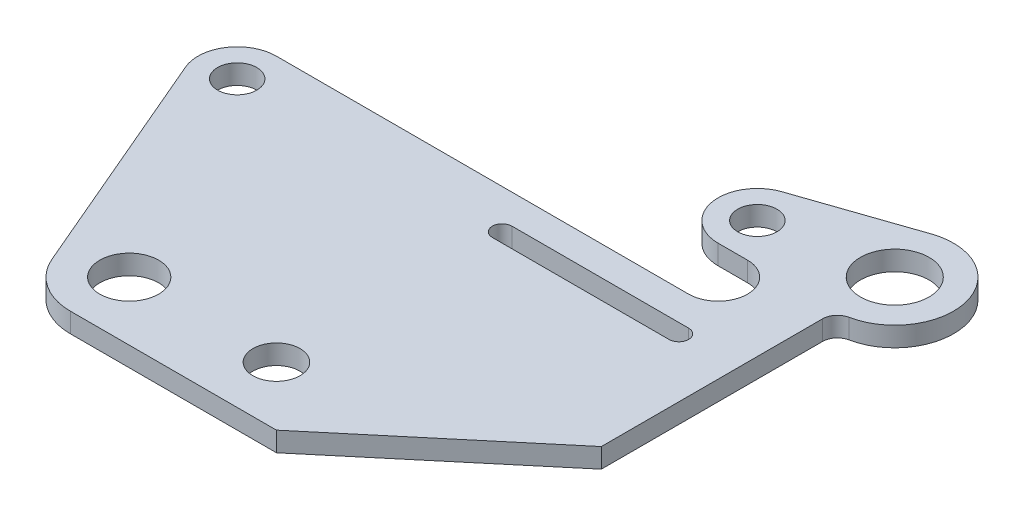
ISO-10303-21;
HEADER;
FILE_DESCRIPTION(('STEP AP214'),'2;1');
FILE_NAME('part.step','',(''),(''),'','','');
FILE_SCHEMA(('AUTOMOTIVE_DESIGN { 1 0 10303 214 1 1 1 1 }'));
ENDSEC;
DATA;
#1=APPLICATION_CONTEXT('core data for automotive mechanical design processes');
#2=APPLICATION_PROTOCOL_DEFINITION('international standard','automotive_design',2000,#1);
#3=PRODUCT_CONTEXT('',#1,'mechanical');
#4=PRODUCT('Part','Part','',(#3));
#5=PRODUCT_RELATED_PRODUCT_CATEGORY('part','',(#4));
#6=PRODUCT_DEFINITION_FORMATION('','',#4);
#7=PRODUCT_DEFINITION_CONTEXT('part definition',#1,'design');
#8=PRODUCT_DEFINITION('design','',#6,#7);
#9=PRODUCT_DEFINITION_SHAPE('','',#8);
#10=(LENGTH_UNIT() NAMED_UNIT(*) SI_UNIT(.MILLI.,.METRE.));
#11=(NAMED_UNIT(*) PLANE_ANGLE_UNIT() SI_UNIT($,.RADIAN.));
#12=(NAMED_UNIT(*) SI_UNIT($,.STERADIAN.) SOLID_ANGLE_UNIT());
#13=UNCERTAINTY_MEASURE_WITH_UNIT(LENGTH_MEASURE(1.E-05),#10,'distance_accuracy_value','');
#14=(GEOMETRIC_REPRESENTATION_CONTEXT(3) GLOBAL_UNCERTAINTY_ASSIGNED_CONTEXT((#13)) GLOBAL_UNIT_ASSIGNED_CONTEXT((#10,
#11,#12)) REPRESENTATION_CONTEXT('',''));
#15=CARTESIAN_POINT('',(0.,0.,0.));
#16=DIRECTION('',(0.,0.,1.));
#17=DIRECTION('',(1.,0.,0.));
#18=AXIS2_PLACEMENT_3D('',#15,#16,#17);
#19=CARTESIAN_POINT('',(0.,12.7,0.));
#20=DIRECTION('',(0.,1.,0.));
#21=DIRECTION('',(0.,0.,1.));
#22=AXIS2_PLACEMENT_3D('',#19,#20,#21);
#23=PLANE('',#22);
#24=CARTESIAN_POINT('',(495.300000000001,12.7,-495.3));
#25=DIRECTION('',(0.,1.,0.));
#26=DIRECTION('',(0.,0.,1.));
#27=AXIS2_PLACEMENT_3D('',#24,#25,#26);
#28=CIRCLE('',#27,44.45);
#29=CARTESIAN_POINT('',(495.300000000001,12.7,-450.85));
#30=VERTEX_POINT('',#29);
#31=EDGE_CURVE('E200',#30,#30,#28,.T.);
#32=ORIENTED_EDGE('',*,*,#31,.F.);
#33=EDGE_LOOP('',(#32));
#34=FACE_BOUND('',#33,.T.);
#35=CARTESIAN_POINT('',(0.,12.7,0.));
#36=DIRECTION('',(0.,1.,0.));
#37=DIRECTION('',(0.,0.,1.));
#38=AXIS2_PLACEMENT_3D('',#35,#36,#37);
#39=CIRCLE('',#38,38.1);
#40=CARTESIAN_POINT('',(0.,12.7,38.1));
#41=VERTEX_POINT('',#40);
#42=EDGE_CURVE('E212',#41,#41,#39,.T.);
#43=ORIENTED_EDGE('',*,*,#42,.F.);
#44=EDGE_LOOP('',(#43));
#45=FACE_BOUND('',#44,.T.);
#46=CARTESIAN_POINT('',(0.,12.7,0.));
#47=DIRECTION('',(0.,1.,0.));
#48=DIRECTION('',(0.,0.,1.));
#49=AXIS2_PLACEMENT_3D('',#46,#47,#48);
#50=CIRCLE('',#49,76.2);
#51=CARTESIAN_POINT('',(-70.0740848982684,12.7,29.934305164314));
#52=VERTEX_POINT('',#51);
#53=CARTESIAN_POINT('',(0.,12.7,76.2));
#54=VERTEX_POINT('',#53);
#55=EDGE_CURVE('E224',#52,#54,#50,.T.);
#56=ORIENTED_EDGE('',*,*,#55,.T.);
#57=DIRECTION('',(1.,0.,0.));
#58=VECTOR('',#57,1.);
#59=CARTESIAN_POINT('',(0.,12.7,76.2));
#60=LINE('',#59,#58);
#61=CARTESIAN_POINT('',(266.700000000001,12.7,76.2));
#62=VERTEX_POINT('',#61);
#63=EDGE_CURVE('E227',#54,#62,#60,.T.);
#64=ORIENTED_EDGE('',*,*,#63,.T.);
#65=DIRECTION('',(0.766044443118977,0.,-0.64278760968654));
#66=VECTOR('',#65,1.);
#67=CARTESIAN_POINT('',(266.700000000001,12.7,76.2));
#68=LINE('',#67,#66);
#69=CARTESIAN_POINT('',(495.300000000001,12.7,-115.618175687127));
#70=VERTEX_POINT('',#69);
#71=EDGE_CURVE('E230',#62,#70,#68,.T.);
#72=ORIENTED_EDGE('',*,*,#71,.T.);
#73=DIRECTION('',(0.,0.,-1.));
#74=VECTOR('',#73,1.);
#75=CARTESIAN_POINT('',(495.300000000001,12.7,-115.618175687127));
#76=LINE('',#75,#74);
#77=CARTESIAN_POINT('',(495.300000000001,12.7,-401.974440799961));
#78=VERTEX_POINT('',#77);
#79=EDGE_CURVE('E232',#70,#78,#76,.T.);
#80=ORIENTED_EDGE('',*,*,#79,.T.);
#81=CARTESIAN_POINT('',(514.350000000001,12.7,-401.974440799961));
#82=DIRECTION('',(0.,-1.,0.));
#83=DIRECTION('',(0.,0.,-1.));
#84=AXIS2_PLACEMENT_3D('',#81,#82,#83);
#85=CIRCLE('',#84,19.0500000000001);
#86=CARTESIAN_POINT('',(510.540000000001,12.7,-420.639552639969));
#87=VERTEX_POINT('',#86);
#88=EDGE_CURVE('E234',#78,#87,#85,.T.);
#89=ORIENTED_EDGE('',*,*,#88,.T.);
#90=CARTESIAN_POINT('',(495.300000000001,12.7,-495.3));
#91=DIRECTION('',(0.,1.,0.));
#92=DIRECTION('',(0.,0.,1.));
#93=AXIS2_PLACEMENT_3D('',#90,#91,#92);
#94=CIRCLE('',#93,76.2);
#95=CARTESIAN_POINT('',(470.586486486487,12.7,-567.381081081081));
#96=VERTEX_POINT('',#95);
#97=EDGE_CURVE('E236',#87,#96,#94,.T.);
#98=ORIENTED_EDGE('',*,*,#97,.T.);
#99=DIRECTION('',(-0.945945945945946,0.,0.324324324324325));
#100=VECTOR('',#99,1.);
#101=CARTESIAN_POINT('',(326.424324324325,12.7,-517.954054054054));
#102=LINE('',#101,#100);
#103=CARTESIAN_POINT('',(326.424324324325,12.7,-517.954054054054));
#104=VERTEX_POINT('',#103);
#105=EDGE_CURVE('E238',#96,#104,#102,.T.);
#106=ORIENTED_EDGE('',*,*,#105,.T.);
#107=CARTESIAN_POINT('',(342.900000000001,12.7,-469.9));
#108=DIRECTION('',(0.,1.,0.));
#109=DIRECTION('',(0.,0.,1.));
#110=AXIS2_PLACEMENT_3D('',#107,#108,#109);
#111=CIRCLE('',#110,50.8000000000001);
#112=CARTESIAN_POINT('',(342.900000000001,12.7,-419.1));
#113=VERTEX_POINT('',#112);
#114=EDGE_CURVE('E240',#104,#113,#111,.T.);
#115=ORIENTED_EDGE('',*,*,#114,.T.);
#116=DIRECTION('',(1.,0.,0.));
#117=VECTOR('',#116,1.);
#118=CARTESIAN_POINT('',(342.900000000001,12.7,-419.1));
#119=LINE('',#118,#117);
#120=CARTESIAN_POINT('',(381.000000000001,12.7,-419.1));
#121=VERTEX_POINT('',#120);
#122=EDGE_CURVE('E242',#113,#121,#119,.T.);
#123=ORIENTED_EDGE('',*,*,#122,.T.);
#124=CARTESIAN_POINT('',(381.000000000001,12.7,-381.));
#125=DIRECTION('',(0.,-1.,0.));
#126=DIRECTION('',(0.,0.,1.));
#127=AXIS2_PLACEMENT_3D('',#124,#125,#126);
#128=CIRCLE('',#127,38.1);
#129=CARTESIAN_POINT('',(381.000000000001,12.7,-342.9));
#130=VERTEX_POINT('',#129);
#131=EDGE_CURVE('E244',#121,#130,#128,.T.);
#132=ORIENTED_EDGE('',*,*,#131,.T.);
#133=DIRECTION('',(-1.,0.,0.));
#134=VECTOR('',#133,1.);
#135=CARTESIAN_POINT('',(-152.4,12.7,-342.9));
#136=LINE('',#135,#134);
#137=CARTESIAN_POINT('',(-152.4,12.7,-342.9));
#138=VERTEX_POINT('',#137);
#139=EDGE_CURVE('E246',#130,#138,#136,.T.);
#140=ORIENTED_EDGE('',*,*,#139,.T.);
#141=CARTESIAN_POINT('',(-152.4,12.7,-292.1));
#142=DIRECTION('',(0.,1.,0.));
#143=DIRECTION('',(0.,0.,1.));
#144=AXIS2_PLACEMENT_3D('',#141,#142,#143);
#145=CIRCLE('',#144,50.8);
#146=CARTESIAN_POINT('',(-199.116056598846,12.7,-272.143796557124));
#147=VERTEX_POINT('',#146);
#148=EDGE_CURVE('E248',#138,#147,#145,.T.);
#149=ORIENTED_EDGE('',*,*,#148,.T.);
#150=DIRECTION('',(0.392838650450314,0.,0.919607413363102));
#151=VECTOR('',#150,1.);
#152=CARTESIAN_POINT('',(-199.116056598846,12.7,-272.143796557124));
#153=LINE('',#152,#151);
#154=EDGE_CURVE('E250',#147,#52,#153,.T.);
#155=ORIENTED_EDGE('',*,*,#154,.T.);
#156=EDGE_LOOP('',(#56,#64,#72,#80,#89,#98,#106,#115,#123,#132,#140,#149,#155));
#157=FACE_BOUND('',#156,.T.);
#158=CARTESIAN_POINT('',(-152.4,12.7,-292.1));
#159=DIRECTION('',(0.,1.,0.));
#160=DIRECTION('',(0.,0.,1.));
#161=AXIS2_PLACEMENT_3D('',#158,#159,#160);
#162=CIRCLE('',#161,25.4);
#163=CARTESIAN_POINT('',(-152.4,12.7,-266.7));
#164=VERTEX_POINT('',#163);
#165=EDGE_CURVE('E218',#164,#164,#162,.T.);
#166=ORIENTED_EDGE('',*,*,#165,.F.);
#167=EDGE_LOOP('',(#166));
#168=FACE_BOUND('',#167,.T.);
#169=CARTESIAN_POINT('',(342.900000000001,12.7,-469.9));
#170=DIRECTION('',(0.,1.,0.));
#171=DIRECTION('',(0.,0.,1.));
#172=AXIS2_PLACEMENT_3D('',#169,#170,#171);
#173=CIRCLE('',#172,25.4);
#174=CARTESIAN_POINT('',(342.900000000001,12.7,-444.5));
#175=VERTEX_POINT('',#174);
#176=EDGE_CURVE('E206',#175,#175,#173,.T.);
#177=ORIENTED_EDGE('',*,*,#176,.F.);
#178=EDGE_LOOP('',(#177));
#179=FACE_BOUND('',#178,.T.);
#180=CARTESIAN_POINT('',(190.5,12.7,0.));
#181=DIRECTION('',(0.,1.,0.));
#182=DIRECTION('',(0.,0.,1.));
#183=AXIS2_PLACEMENT_3D('',#180,#181,#182);
#184=CIRCLE('',#183,30.48);
#185=CARTESIAN_POINT('',(190.5,12.7,30.48));
#186=VERTEX_POINT('',#185);
#187=EDGE_CURVE('E194',#186,#186,#184,.T.);
#188=ORIENTED_EDGE('',*,*,#187,.F.);
#189=EDGE_LOOP('',(#188));
#190=FACE_BOUND('',#189,.T.);
#191=DIRECTION('',(1.,0.,0.));
#192=VECTOR('',#191,1.);
#193=CARTESIAN_POINT('',(190.5,12.7,-279.4));
#194=LINE('',#193,#192);
#195=CARTESIAN_POINT('',(190.5,12.7,-279.4));
#196=VERTEX_POINT('',#195);
#197=CARTESIAN_POINT('',(419.1,12.7,-279.4));
#198=VERTEX_POINT('',#197);
#199=EDGE_CURVE('E166',#196,#198,#194,.T.);
#200=ORIENTED_EDGE('',*,*,#199,.F.);
#201=CARTESIAN_POINT('',(190.5,12.7,-292.1));
#202=DIRECTION('',(0.,1.,0.));
#203=DIRECTION('',(0.,0.,1.));
#204=AXIS2_PLACEMENT_3D('',#201,#202,#203);
#205=CIRCLE('',#204,12.7);
#206=CARTESIAN_POINT('',(190.5,12.7,-304.8));
#207=VERTEX_POINT('',#206);
#208=EDGE_CURVE('E158',#207,#196,#205,.T.);
#209=ORIENTED_EDGE('',*,*,#208,.F.);
#210=DIRECTION('',(-1.,0.,0.));
#211=VECTOR('',#210,1.);
#212=CARTESIAN_POINT('',(190.5,12.7,-304.8));
#213=LINE('',#212,#211);
#214=CARTESIAN_POINT('',(419.1,12.7,-304.8));
#215=VERTEX_POINT('',#214);
#216=EDGE_CURVE('E180',#215,#207,#213,.T.);
#217=ORIENTED_EDGE('',*,*,#216,.F.);
#218=CARTESIAN_POINT('',(419.1,12.7,-292.1));
#219=DIRECTION('',(0.,1.,0.));
#220=DIRECTION('',(0.,0.,1.));
#221=AXIS2_PLACEMENT_3D('',#218,#219,#220);
#222=CIRCLE('',#221,12.7);
#223=EDGE_CURVE('E178',#198,#215,#222,.T.);
#224=ORIENTED_EDGE('',*,*,#223,.F.);
#225=EDGE_LOOP('',(#200,#209,#217,#224));
#226=FACE_BOUND('',#225,.T.);
#227=ADVANCED_FACE('F39',(#34,#45,#157,#168,#179,#190,#226),#23,.T.);
#228=CARTESIAN_POINT('',(0.,-12.7,0.));
#229=DIRECTION('',(0.,1.,0.));
#230=DIRECTION('',(0.,0.,1.));
#231=AXIS2_PLACEMENT_3D('',#228,#229,#230);
#232=PLANE('',#231);
#233=CARTESIAN_POINT('',(190.5,-12.7,0.));
#234=DIRECTION('',(0.,1.,0.));
#235=DIRECTION('',(0.,0.,1.));
#236=AXIS2_PLACEMENT_3D('',#233,#234,#235);
#237=CIRCLE('',#236,30.48);
#238=CARTESIAN_POINT('',(190.5,-12.7,30.48));
#239=VERTEX_POINT('',#238);
#240=EDGE_CURVE('E174',#239,#239,#237,.T.);
#241=ORIENTED_EDGE('',*,*,#240,.T.);
#242=EDGE_LOOP('',(#241));
#243=FACE_BOUND('',#242,.T.);
#244=CARTESIAN_POINT('',(495.300000000001,-12.7,-495.3));
#245=DIRECTION('',(0.,1.,0.));
#246=DIRECTION('',(0.,0.,1.));
#247=AXIS2_PLACEMENT_3D('',#244,#245,#246);
#248=CIRCLE('',#247,44.45);
#249=CARTESIAN_POINT('',(495.300000000001,-12.7,-450.85));
#250=VERTEX_POINT('',#249);
#251=EDGE_CURVE('E197',#250,#250,#248,.T.);
#252=ORIENTED_EDGE('',*,*,#251,.T.);
#253=EDGE_LOOP('',(#252));
#254=FACE_BOUND('',#253,.T.);
#255=CARTESIAN_POINT('',(342.900000000001,-12.7,-469.9));
#256=DIRECTION('',(0.,1.,0.));
#257=DIRECTION('',(0.,0.,1.));
#258=AXIS2_PLACEMENT_3D('',#255,#256,#257);
#259=CIRCLE('',#258,25.4);
#260=CARTESIAN_POINT('',(342.900000000001,-12.7,-444.5));
#261=VERTEX_POINT('',#260);
#262=EDGE_CURVE('E203',#261,#261,#259,.T.);
#263=ORIENTED_EDGE('',*,*,#262,.T.);
#264=EDGE_LOOP('',(#263));
#265=FACE_BOUND('',#264,.T.);
#266=CARTESIAN_POINT('',(0.,-12.7,0.));
#267=DIRECTION('',(0.,1.,0.));
#268=DIRECTION('',(0.,0.,1.));
#269=AXIS2_PLACEMENT_3D('',#266,#267,#268);
#270=CIRCLE('',#269,38.1);
#271=CARTESIAN_POINT('',(0.,-12.7,38.1));
#272=VERTEX_POINT('',#271);
#273=EDGE_CURVE('E209',#272,#272,#270,.T.);
#274=ORIENTED_EDGE('',*,*,#273,.T.);
#275=EDGE_LOOP('',(#274));
#276=FACE_BOUND('',#275,.T.);
#277=CARTESIAN_POINT('',(-152.4,-12.7,-292.1));
#278=DIRECTION('',(0.,1.,0.));
#279=DIRECTION('',(0.,0.,1.));
#280=AXIS2_PLACEMENT_3D('',#277,#278,#279);
#281=CIRCLE('',#280,25.4);
#282=CARTESIAN_POINT('',(-152.4,-12.7,-266.7));
#283=VERTEX_POINT('',#282);
#284=EDGE_CURVE('E215',#283,#283,#281,.T.);
#285=ORIENTED_EDGE('',*,*,#284,.T.);
#286=EDGE_LOOP('',(#285));
#287=FACE_BOUND('',#286,.T.);
#288=CARTESIAN_POINT('',(0.,-12.7,0.));
#289=DIRECTION('',(0.,1.,0.));
#290=DIRECTION('',(0.,0.,1.));
#291=AXIS2_PLACEMENT_3D('',#288,#289,#290);
#292=CIRCLE('',#291,76.2);
#293=CARTESIAN_POINT('',(-70.0740848982684,-12.7,29.934305164314));
#294=VERTEX_POINT('',#293);
#295=CARTESIAN_POINT('',(0.,-12.7,76.2));
#296=VERTEX_POINT('',#295);
#297=EDGE_CURVE('E221',#294,#296,#292,.T.);
#298=ORIENTED_EDGE('',*,*,#297,.F.);
#299=DIRECTION('',(0.392838650450314,0.,0.919607413363102));
#300=VECTOR('',#299,1.);
#301=CARTESIAN_POINT('',(-199.116056598846,-12.7,-272.143796557124));
#302=LINE('',#301,#300);
#303=CARTESIAN_POINT('',(-199.116056598846,-12.7,-272.143796557124));
#304=VERTEX_POINT('',#303);
#305=EDGE_CURVE('E228',#304,#294,#302,.T.);
#306=ORIENTED_EDGE('',*,*,#305,.F.);
#307=CARTESIAN_POINT('',(-152.4,-12.7,-292.1));
#308=DIRECTION('',(0.,1.,0.));
#309=DIRECTION('',(0.,0.,1.));
#310=AXIS2_PLACEMENT_3D('',#307,#308,#309);
#311=CIRCLE('',#310,50.8);
#312=CARTESIAN_POINT('',(-152.4,-12.7,-342.9));
#313=VERTEX_POINT('',#312);
#314=EDGE_CURVE('E275',#313,#304,#311,.T.);
#315=ORIENTED_EDGE('',*,*,#314,.F.);
#316=DIRECTION('',(-1.,0.,0.));
#317=VECTOR('',#316,1.);
#318=CARTESIAN_POINT('',(-152.4,-12.7,-342.9));
#319=LINE('',#318,#317);
#320=CARTESIAN_POINT('',(381.000000000001,-12.7,-342.9));
#321=VERTEX_POINT('',#320);
#322=EDGE_CURVE('E273',#321,#313,#319,.T.);
#323=ORIENTED_EDGE('',*,*,#322,.F.);
#324=CARTESIAN_POINT('',(381.000000000001,-12.7,-381.));
#325=DIRECTION('',(0.,-1.,0.));
#326=DIRECTION('',(0.,0.,1.));
#327=AXIS2_PLACEMENT_3D('',#324,#325,#326);
#328=CIRCLE('',#327,38.1);
#329=CARTESIAN_POINT('',(381.000000000001,-12.7,-419.1));
#330=VERTEX_POINT('',#329);
#331=EDGE_CURVE('E271',#330,#321,#328,.T.);
#332=ORIENTED_EDGE('',*,*,#331,.F.);
#333=DIRECTION('',(1.,0.,0.));
#334=VECTOR('',#333,1.);
#335=CARTESIAN_POINT('',(342.900000000001,-12.7,-419.1));
#336=LINE('',#335,#334);
#337=CARTESIAN_POINT('',(342.900000000001,-12.7,-419.1));
#338=VERTEX_POINT('',#337);
#339=EDGE_CURVE('E269',#338,#330,#336,.T.);
#340=ORIENTED_EDGE('',*,*,#339,.F.);
#341=CARTESIAN_POINT('',(342.900000000001,-12.7,-469.9));
#342=DIRECTION('',(0.,1.,0.));
#343=DIRECTION('',(0.,0.,1.));
#344=AXIS2_PLACEMENT_3D('',#341,#342,#343);
#345=CIRCLE('',#344,50.8000000000001);
#346=CARTESIAN_POINT('',(326.424324324325,-12.7,-517.954054054054));
#347=VERTEX_POINT('',#346);
#348=EDGE_CURVE('E267',#347,#338,#345,.T.);
#349=ORIENTED_EDGE('',*,*,#348,.F.);
#350=DIRECTION('',(-0.945945945945946,0.,0.324324324324325));
#351=VECTOR('',#350,1.);
#352=CARTESIAN_POINT('',(326.424324324325,-12.7,-517.954054054054));
#353=LINE('',#352,#351);
#354=CARTESIAN_POINT('',(470.586486486487,-12.7,-567.381081081081));
#355=VERTEX_POINT('',#354);
#356=EDGE_CURVE('E265',#355,#347,#353,.T.);
#357=ORIENTED_EDGE('',*,*,#356,.F.);
#358=CARTESIAN_POINT('',(495.300000000001,-12.7,-495.3));
#359=DIRECTION('',(0.,1.,0.));
#360=DIRECTION('',(0.,0.,1.));
#361=AXIS2_PLACEMENT_3D('',#358,#359,#360);
#362=CIRCLE('',#361,76.2);
#363=CARTESIAN_POINT('',(510.540000000001,-12.7,-420.639552639969));
#364=VERTEX_POINT('',#363);
#365=EDGE_CURVE('E263',#364,#355,#362,.T.);
#366=ORIENTED_EDGE('',*,*,#365,.F.);
#367=CARTESIAN_POINT('',(514.350000000001,-12.7,-401.974440799961));
#368=DIRECTION('',(0.,-1.,0.));
#369=DIRECTION('',(0.,0.,-1.));
#370=AXIS2_PLACEMENT_3D('',#367,#368,#369);
#371=CIRCLE('',#370,19.0500000000001);
#372=CARTESIAN_POINT('',(495.300000000001,-12.7,-401.974440799961));
#373=VERTEX_POINT('',#372);
#374=EDGE_CURVE('E261',#373,#364,#371,.T.);
#375=ORIENTED_EDGE('',*,*,#374,.F.);
#376=DIRECTION('',(0.,0.,-1.));
#377=VECTOR('',#376,1.);
#378=CARTESIAN_POINT('',(495.300000000001,-12.7,-115.618175687127));
#379=LINE('',#378,#377);
#380=CARTESIAN_POINT('',(495.300000000001,-12.7,-115.618175687127));
#381=VERTEX_POINT('',#380);
#382=EDGE_CURVE('E259',#381,#373,#379,.T.);
#383=ORIENTED_EDGE('',*,*,#382,.F.);
#384=DIRECTION('',(0.766044443118977,0.,-0.64278760968654));
#385=VECTOR('',#384,1.);
#386=CARTESIAN_POINT('',(266.700000000001,-12.7,76.2));
#387=LINE('',#386,#385);
#388=CARTESIAN_POINT('',(266.700000000001,-12.7,76.2));
#389=VERTEX_POINT('',#388);
#390=EDGE_CURVE('E257',#389,#381,#387,.T.);
#391=ORIENTED_EDGE('',*,*,#390,.F.);
#392=DIRECTION('',(1.,0.,0.));
#393=VECTOR('',#392,1.);
#394=CARTESIAN_POINT('',(0.,-12.7,76.2));
#395=LINE('',#394,#393);
#396=EDGE_CURVE('E255',#296,#389,#395,.T.);
#397=ORIENTED_EDGE('',*,*,#396,.F.);
#398=EDGE_LOOP('',(#298,#306,#315,#323,#332,#340,#349,#357,#366,#375,#383,#391,#397));
#399=FACE_BOUND('',#398,.T.);
#400=CARTESIAN_POINT('',(190.5,-12.7,-292.1));
#401=DIRECTION('',(0.,1.,0.));
#402=DIRECTION('',(0.,0.,1.));
#403=AXIS2_PLACEMENT_3D('',#400,#401,#402);
#404=CIRCLE('',#403,12.7);
#405=CARTESIAN_POINT('',(190.5,-12.7,-304.8));
#406=VERTEX_POINT('',#405);
#407=CARTESIAN_POINT('',(190.5,-12.7,-279.4));
#408=VERTEX_POINT('',#407);
#409=EDGE_CURVE('E62',#406,#408,#404,.T.);
#410=ORIENTED_EDGE('',*,*,#409,.T.);
#411=DIRECTION('',(1.,0.,0.));
#412=VECTOR('',#411,1.);
#413=CARTESIAN_POINT('',(190.5,-12.7,-279.4));
#414=LINE('',#413,#412);
#415=CARTESIAN_POINT('',(419.1,-12.7,-279.4));
#416=VERTEX_POINT('',#415);
#417=EDGE_CURVE('E173',#408,#416,#414,.T.);
#418=ORIENTED_EDGE('',*,*,#417,.T.);
#419=CARTESIAN_POINT('',(419.1,-12.7,-292.1));
#420=DIRECTION('',(0.,1.,0.));
#421=DIRECTION('',(0.,0.,1.));
#422=AXIS2_PLACEMENT_3D('',#419,#420,#421);
#423=CIRCLE('',#422,12.7);
#424=CARTESIAN_POINT('',(419.1,-12.7,-304.8));
#425=VERTEX_POINT('',#424);
#426=EDGE_CURVE('E186',#416,#425,#423,.T.);
#427=ORIENTED_EDGE('',*,*,#426,.T.);
#428=DIRECTION('',(-1.,0.,0.));
#429=VECTOR('',#428,1.);
#430=CARTESIAN_POINT('',(190.5,-12.7,-304.8));
#431=LINE('',#430,#429);
#432=EDGE_CURVE('E167',#425,#406,#431,.T.);
#433=ORIENTED_EDGE('',*,*,#432,.T.);
#434=EDGE_LOOP('',(#410,#418,#427,#433));
#435=FACE_BOUND('',#434,.T.);
#436=ADVANCED_FACE('F320',(#243,#254,#265,#276,#287,#399,#435),#232,.F.);
#437=CARTESIAN_POINT('',(0.,12.7,0.));
#438=DIRECTION('',(0.,-1.,0.));
#439=DIRECTION('',(0.,0.,-1.));
#440=AXIS2_PLACEMENT_3D('',#437,#438,#439);
#441=CYLINDRICAL_SURFACE('',#440,76.2);
#442=ORIENTED_EDGE('',*,*,#297,.T.);
#443=DIRECTION('',(0.,-1.,0.));
#444=VECTOR('',#443,1.);
#445=CARTESIAN_POINT('',(0.,12.7,76.2));
#446=LINE('',#445,#444);
#447=EDGE_CURVE('E11',#54,#296,#446,.T.);
#448=ORIENTED_EDGE('',*,*,#447,.F.);
#449=ORIENTED_EDGE('',*,*,#55,.F.);
#450=DIRECTION('',(0.,-1.,0.));
#451=VECTOR('',#450,1.);
#452=CARTESIAN_POINT('',(-70.0740848982684,12.7,29.934305164314));
#453=LINE('',#452,#451);
#454=EDGE_CURVE('E252',#52,#294,#453,.T.);
#455=ORIENTED_EDGE('',*,*,#454,.T.);
#456=EDGE_LOOP('',(#442,#448,#449,#455));
#457=FACE_BOUND('',#456,.T.);
#458=ADVANCED_FACE('F41',(#457),#441,.T.);
#459=CARTESIAN_POINT('',(0.,12.7,76.2));
#460=DIRECTION('',(0.,0.,-1.));
#461=DIRECTION('',(-1.,0.,0.));
#462=AXIS2_PLACEMENT_3D('',#459,#460,#461);
#463=PLANE('',#462);
#464=ORIENTED_EDGE('',*,*,#396,.T.);
#465=DIRECTION('',(0.,-1.,0.));
#466=VECTOR('',#465,1.);
#467=CARTESIAN_POINT('',(266.700000000001,12.7,76.2));
#468=LINE('',#467,#466);
#469=EDGE_CURVE('E47',#62,#389,#468,.T.);
#470=ORIENTED_EDGE('',*,*,#469,.F.);
#471=ORIENTED_EDGE('',*,*,#63,.F.);
#472=ORIENTED_EDGE('',*,*,#447,.T.);
#473=EDGE_LOOP('',(#464,#470,#471,#472));
#474=FACE_BOUND('',#473,.T.);
#475=ADVANCED_FACE('F338',(#474),#463,.F.);
#476=CARTESIAN_POINT('',(266.700000000001,12.7,76.2));
#477=DIRECTION('',(-0.64278760968654,0.,-0.766044443118977));
#478=DIRECTION('',(-0.766044443118977,0.,0.64278760968654));
#479=AXIS2_PLACEMENT_3D('',#476,#477,#478);
#480=PLANE('',#479);
#481=ORIENTED_EDGE('',*,*,#390,.T.);
#482=DIRECTION('',(0.,-1.,0.));
#483=VECTOR('',#482,1.);
#484=CARTESIAN_POINT('',(495.300000000001,12.7,-115.618175687127));
#485=LINE('',#484,#483);
#486=EDGE_CURVE('E307',#70,#381,#485,.T.);
#487=ORIENTED_EDGE('',*,*,#486,.F.);
#488=ORIENTED_EDGE('',*,*,#71,.F.);
#489=ORIENTED_EDGE('',*,*,#469,.T.);
#490=EDGE_LOOP('',(#481,#487,#488,#489));
#491=FACE_BOUND('',#490,.T.);
#492=ADVANCED_FACE('F314',(#491),#480,.F.);
#493=CARTESIAN_POINT('',(495.300000000001,12.7,-115.618175687127));
#494=DIRECTION('',(-1.,0.,0.));
#495=DIRECTION('',(0.,0.,1.));
#496=AXIS2_PLACEMENT_3D('',#493,#494,#495);
#497=PLANE('',#496);
#498=ORIENTED_EDGE('',*,*,#382,.T.);
#499=DIRECTION('',(0.,-1.,0.));
#500=VECTOR('',#499,1.);
#501=CARTESIAN_POINT('',(495.300000000001,12.7,-401.974440799961));
#502=LINE('',#501,#500);
#503=EDGE_CURVE('E304',#78,#373,#502,.T.);
#504=ORIENTED_EDGE('',*,*,#503,.F.);
#505=ORIENTED_EDGE('',*,*,#79,.F.);
#506=ORIENTED_EDGE('',*,*,#486,.T.);
#507=EDGE_LOOP('',(#498,#504,#505,#506));
#508=FACE_BOUND('',#507,.T.);
#509=ADVANCED_FACE('F326',(#508),#497,.F.);
#510=CARTESIAN_POINT('',(514.350000000001,12.7,-401.974440799961));
#511=DIRECTION('',(0.,-1.,0.));
#512=DIRECTION('',(0.,0.,-1.));
#513=AXIS2_PLACEMENT_3D('',#510,#511,#512);
#514=CYLINDRICAL_SURFACE('',#513,19.0500000000001);
#515=ORIENTED_EDGE('',*,*,#374,.T.);
#516=DIRECTION('',(0.,-1.,0.));
#517=VECTOR('',#516,1.);
#518=CARTESIAN_POINT('',(510.540000000001,12.7,-420.639552639969));
#519=LINE('',#518,#517);
#520=EDGE_CURVE('E301',#87,#364,#519,.T.);
#521=ORIENTED_EDGE('',*,*,#520,.F.);
#522=ORIENTED_EDGE('',*,*,#88,.F.);
#523=ORIENTED_EDGE('',*,*,#503,.T.);
#524=EDGE_LOOP('',(#515,#521,#522,#523));
#525=FACE_BOUND('',#524,.T.);
#526=ADVANCED_FACE('F330',(#525),#514,.F.);
#527=CARTESIAN_POINT('',(495.300000000001,12.7,-495.3));
#528=DIRECTION('',(0.,-1.,0.));
#529=DIRECTION('',(0.,0.,-1.));
#530=AXIS2_PLACEMENT_3D('',#527,#528,#529);
#531=CYLINDRICAL_SURFACE('',#530,76.2);
#532=ORIENTED_EDGE('',*,*,#365,.T.);
#533=DIRECTION('',(0.,-1.,0.));
#534=VECTOR('',#533,1.);
#535=CARTESIAN_POINT('',(470.586486486487,12.7,-567.381081081081));
#536=LINE('',#535,#534);
#537=EDGE_CURVE('E298',#96,#355,#536,.T.);
#538=ORIENTED_EDGE('',*,*,#537,.F.);
#539=ORIENTED_EDGE('',*,*,#97,.F.);
#540=ORIENTED_EDGE('',*,*,#520,.T.);
#541=EDGE_LOOP('',(#532,#538,#539,#540));
#542=FACE_BOUND('',#541,.T.);
#543=ADVANCED_FACE('F376',(#542),#531,.T.);
#544=CARTESIAN_POINT('',(326.424324324325,12.7,-517.954054054054));
#545=DIRECTION('',(0.324324324324325,0.,0.945945945945946));
#546=DIRECTION('',(0.945945945945946,0.,-0.324324324324325));
#547=AXIS2_PLACEMENT_3D('',#544,#545,#546);
#548=PLANE('',#547);
#549=ORIENTED_EDGE('',*,*,#356,.T.);
#550=DIRECTION('',(0.,-1.,0.));
#551=VECTOR('',#550,1.);
#552=CARTESIAN_POINT('',(326.424324324325,12.7,-517.954054054054));
#553=LINE('',#552,#551);
#554=EDGE_CURVE('E295',#104,#347,#553,.T.);
#555=ORIENTED_EDGE('',*,*,#554,.F.);
#556=ORIENTED_EDGE('',*,*,#105,.F.);
#557=ORIENTED_EDGE('',*,*,#537,.T.);
#558=EDGE_LOOP('',(#549,#555,#556,#557));
#559=FACE_BOUND('',#558,.T.);
#560=ADVANCED_FACE('F373',(#559),#548,.F.);
#561=CARTESIAN_POINT('',(342.900000000001,12.7,-469.9));
#562=DIRECTION('',(0.,-1.,0.));
#563=DIRECTION('',(0.,0.,-1.));
#564=AXIS2_PLACEMENT_3D('',#561,#562,#563);
#565=CYLINDRICAL_SURFACE('',#564,50.8000000000001);
#566=ORIENTED_EDGE('',*,*,#348,.T.);
#567=DIRECTION('',(0.,-1.,0.));
#568=VECTOR('',#567,1.);
#569=CARTESIAN_POINT('',(342.900000000001,12.7,-419.1));
#570=LINE('',#569,#568);
#571=EDGE_CURVE('E292',#113,#338,#570,.T.);
#572=ORIENTED_EDGE('',*,*,#571,.F.);
#573=ORIENTED_EDGE('',*,*,#114,.F.);
#574=ORIENTED_EDGE('',*,*,#554,.T.);
#575=EDGE_LOOP('',(#566,#572,#573,#574));
#576=FACE_BOUND('',#575,.T.);
#577=ADVANCED_FACE('F369',(#576),#565,.T.);
#578=CARTESIAN_POINT('',(342.900000000001,12.7,-419.1));
#579=DIRECTION('',(0.,0.,-1.));
#580=DIRECTION('',(-1.,0.,0.));
#581=AXIS2_PLACEMENT_3D('',#578,#579,#580);
#582=PLANE('',#581);
#583=ORIENTED_EDGE('',*,*,#339,.T.);
#584=DIRECTION('',(0.,-1.,0.));
#585=VECTOR('',#584,1.);
#586=CARTESIAN_POINT('',(381.000000000001,12.7,-419.1));
#587=LINE('',#586,#585);
#588=EDGE_CURVE('E289',#121,#330,#587,.T.);
#589=ORIENTED_EDGE('',*,*,#588,.F.);
#590=ORIENTED_EDGE('',*,*,#122,.F.);
#591=ORIENTED_EDGE('',*,*,#571,.T.);
#592=EDGE_LOOP('',(#583,#589,#590,#591));
#593=FACE_BOUND('',#592,.T.);
#594=ADVANCED_FACE('F365',(#593),#582,.F.);
#595=CARTESIAN_POINT('',(381.000000000001,12.7,-381.));
#596=DIRECTION('',(0.,-1.,0.));
#597=DIRECTION('',(0.,0.,-1.));
#598=AXIS2_PLACEMENT_3D('',#595,#596,#597);
#599=CYLINDRICAL_SURFACE('',#598,38.1);
#600=ORIENTED_EDGE('',*,*,#331,.T.);
#601=DIRECTION('',(0.,-1.,0.));
#602=VECTOR('',#601,1.);
#603=CARTESIAN_POINT('',(381.000000000001,12.7,-342.9));
#604=LINE('',#603,#602);
#605=EDGE_CURVE('E286',#130,#321,#604,.T.);
#606=ORIENTED_EDGE('',*,*,#605,.F.);
#607=ORIENTED_EDGE('',*,*,#131,.F.);
#608=ORIENTED_EDGE('',*,*,#588,.T.);
#609=EDGE_LOOP('',(#600,#606,#607,#608));
#610=FACE_BOUND('',#609,.T.);
#611=ADVANCED_FACE('F360',(#610),#599,.F.);
#612=CARTESIAN_POINT('',(-152.4,12.7,-342.9));
#613=DIRECTION('',(0.,0.,1.));
#614=DIRECTION('',(1.,0.,0.));
#615=AXIS2_PLACEMENT_3D('',#612,#613,#614);
#616=PLANE('',#615);
#617=ORIENTED_EDGE('',*,*,#322,.T.);
#618=DIRECTION('',(0.,-1.,0.));
#619=VECTOR('',#618,1.);
#620=CARTESIAN_POINT('',(-152.4,12.7,-342.9));
#621=LINE('',#620,#619);
#622=EDGE_CURVE('E283',#138,#313,#621,.T.);
#623=ORIENTED_EDGE('',*,*,#622,.F.);
#624=ORIENTED_EDGE('',*,*,#139,.F.);
#625=ORIENTED_EDGE('',*,*,#605,.T.);
#626=EDGE_LOOP('',(#617,#623,#624,#625));
#627=FACE_BOUND('',#626,.T.);
#628=ADVANCED_FACE('F354',(#627),#616,.F.);
#629=CARTESIAN_POINT('',(-152.4,12.7,-292.1));
#630=DIRECTION('',(0.,-1.,0.));
#631=DIRECTION('',(0.,0.,-1.));
#632=AXIS2_PLACEMENT_3D('',#629,#630,#631);
#633=CYLINDRICAL_SURFACE('',#632,50.8);
#634=ORIENTED_EDGE('',*,*,#314,.T.);
#635=DIRECTION('',(0.,-1.,0.));
#636=VECTOR('',#635,1.);
#637=CARTESIAN_POINT('',(-199.116056598846,12.7,-272.143796557124));
#638=LINE('',#637,#636);
#639=EDGE_CURVE('E280',#147,#304,#638,.T.);
#640=ORIENTED_EDGE('',*,*,#639,.F.);
#641=ORIENTED_EDGE('',*,*,#148,.F.);
#642=ORIENTED_EDGE('',*,*,#622,.T.);
#643=EDGE_LOOP('',(#634,#640,#641,#642));
#644=FACE_BOUND('',#643,.T.);
#645=ADVANCED_FACE('F350',(#644),#633,.T.);
#646=CARTESIAN_POINT('',(-199.116056598846,12.7,-272.143796557124));
#647=DIRECTION('',(0.919607413363102,0.,-0.392838650450314));
#648=DIRECTION('',(-0.392838650450314,0.,-0.919607413363102));
#649=AXIS2_PLACEMENT_3D('',#646,#647,#648);
#650=PLANE('',#649);
#651=ORIENTED_EDGE('',*,*,#305,.T.);
#652=ORIENTED_EDGE('',*,*,#454,.F.);
#653=ORIENTED_EDGE('',*,*,#154,.F.);
#654=ORIENTED_EDGE('',*,*,#639,.T.);
#655=EDGE_LOOP('',(#651,#652,#653,#654));
#656=FACE_BOUND('',#655,.T.);
#657=ADVANCED_FACE('F345',(#656),#650,.F.);
#658=CARTESIAN_POINT('',(-152.4,12.7,-292.1));
#659=DIRECTION('',(0.,-1.,0.));
#660=DIRECTION('',(0.,0.,-1.));
#661=AXIS2_PLACEMENT_3D('',#658,#659,#660);
#662=CYLINDRICAL_SURFACE('',#661,25.4);
#663=ORIENTED_EDGE('',*,*,#165,.T.);
#664=EDGE_LOOP('',(#663));
#665=FACE_BOUND('',#664,.T.);
#666=ORIENTED_EDGE('',*,*,#284,.F.);
#667=EDGE_LOOP('',(#666));
#668=FACE_BOUND('',#667,.T.);
#669=ADVANCED_FACE('F396',(#665,#668),#662,.F.);
#670=CARTESIAN_POINT('',(0.,12.7,0.));
#671=DIRECTION('',(0.,-1.,0.));
#672=DIRECTION('',(0.,0.,-1.));
#673=AXIS2_PLACEMENT_3D('',#670,#671,#672);
#674=CYLINDRICAL_SURFACE('',#673,38.1);
#675=ORIENTED_EDGE('',*,*,#42,.T.);
#676=EDGE_LOOP('',(#675));
#677=FACE_BOUND('',#676,.T.);
#678=ORIENTED_EDGE('',*,*,#273,.F.);
#679=EDGE_LOOP('',(#678));
#680=FACE_BOUND('',#679,.T.);
#681=ADVANCED_FACE('F446',(#677,#680),#674,.F.);
#682=CARTESIAN_POINT('',(342.900000000001,12.7,-469.9));
#683=DIRECTION('',(0.,-1.,0.));
#684=DIRECTION('',(0.,0.,-1.));
#685=AXIS2_PLACEMENT_3D('',#682,#683,#684);
#686=CYLINDRICAL_SURFACE('',#685,25.4);
#687=ORIENTED_EDGE('',*,*,#176,.T.);
#688=EDGE_LOOP('',(#687));
#689=FACE_BOUND('',#688,.T.);
#690=ORIENTED_EDGE('',*,*,#262,.F.);
#691=EDGE_LOOP('',(#690));
#692=FACE_BOUND('',#691,.T.);
#693=ADVANCED_FACE('F454',(#689,#692),#686,.F.);
#694=CARTESIAN_POINT('',(495.300000000001,12.7,-495.3));
#695=DIRECTION('',(0.,-1.,0.));
#696=DIRECTION('',(0.,0.,-1.));
#697=AXIS2_PLACEMENT_3D('',#694,#695,#696);
#698=CYLINDRICAL_SURFACE('',#697,44.45);
#699=ORIENTED_EDGE('',*,*,#31,.T.);
#700=EDGE_LOOP('',(#699));
#701=FACE_BOUND('',#700,.T.);
#702=ORIENTED_EDGE('',*,*,#251,.F.);
#703=EDGE_LOOP('',(#702));
#704=FACE_BOUND('',#703,.T.);
#705=ADVANCED_FACE('F462',(#701,#704),#698,.F.);
#706=CARTESIAN_POINT('',(190.5,12.7,0.));
#707=DIRECTION('',(0.,-1.,0.));
#708=DIRECTION('',(0.,0.,-1.));
#709=AXIS2_PLACEMENT_3D('',#706,#707,#708);
#710=CYLINDRICAL_SURFACE('',#709,30.48);
#711=ORIENTED_EDGE('',*,*,#187,.T.);
#712=EDGE_LOOP('',(#711));
#713=FACE_BOUND('',#712,.T.);
#714=ORIENTED_EDGE('',*,*,#240,.F.);
#715=EDGE_LOOP('',(#714));
#716=FACE_BOUND('',#715,.T.);
#717=ADVANCED_FACE('F471',(#713,#716),#710,.F.);
#718=CARTESIAN_POINT('',(190.5,12.7,-292.1));
#719=DIRECTION('',(0.,-1.,0.));
#720=DIRECTION('',(0.,0.,-1.));
#721=AXIS2_PLACEMENT_3D('',#718,#719,#720);
#722=CYLINDRICAL_SURFACE('',#721,12.7);
#723=ORIENTED_EDGE('',*,*,#409,.F.);
#724=DIRECTION('',(0.,-1.,0.));
#725=VECTOR('',#724,1.);
#726=CARTESIAN_POINT('',(190.5,12.7,-304.8));
#727=LINE('',#726,#725);
#728=EDGE_CURVE('E162',#207,#406,#727,.T.);
#729=ORIENTED_EDGE('',*,*,#728,.F.);
#730=ORIENTED_EDGE('',*,*,#208,.T.);
#731=DIRECTION('',(0.,-1.,0.));
#732=VECTOR('',#731,1.);
#733=CARTESIAN_POINT('',(190.5,12.7,-279.4));
#734=LINE('',#733,#732);
#735=EDGE_CURVE('E161',#196,#408,#734,.T.);
#736=ORIENTED_EDGE('',*,*,#735,.T.);
#737=EDGE_LOOP('',(#723,#729,#730,#736));
#738=FACE_BOUND('',#737,.T.);
#739=ADVANCED_FACE('F160',(#738),#722,.F.);
#740=CARTESIAN_POINT('',(190.5,12.7,-279.4));
#741=DIRECTION('',(0.,0.,-1.));
#742=DIRECTION('',(-1.,0.,0.));
#743=AXIS2_PLACEMENT_3D('',#740,#741,#742);
#744=PLANE('',#743);
#745=ORIENTED_EDGE('',*,*,#417,.F.);
#746=ORIENTED_EDGE('',*,*,#735,.F.);
#747=ORIENTED_EDGE('',*,*,#199,.T.);
#748=DIRECTION('',(0.,-1.,0.));
#749=VECTOR('',#748,1.);
#750=CARTESIAN_POINT('',(419.1,12.7,-279.4));
#751=LINE('',#750,#749);
#752=EDGE_CURVE('E175',#198,#416,#751,.T.);
#753=ORIENTED_EDGE('',*,*,#752,.T.);
#754=EDGE_LOOP('',(#745,#746,#747,#753));
#755=FACE_BOUND('',#754,.T.);
#756=ADVANCED_FACE('F170',(#755),#744,.T.);
#757=CARTESIAN_POINT('',(419.1,12.7,-292.1));
#758=DIRECTION('',(0.,-1.,0.));
#759=DIRECTION('',(0.,0.,-1.));
#760=AXIS2_PLACEMENT_3D('',#757,#758,#759);
#761=CYLINDRICAL_SURFACE('',#760,12.7);
#762=ORIENTED_EDGE('',*,*,#426,.F.);
#763=ORIENTED_EDGE('',*,*,#752,.F.);
#764=ORIENTED_EDGE('',*,*,#223,.T.);
#765=DIRECTION('',(0.,-1.,0.));
#766=VECTOR('',#765,1.);
#767=CARTESIAN_POINT('',(419.1,12.7,-304.8));
#768=LINE('',#767,#766);
#769=EDGE_CURVE('E54',#215,#425,#768,.T.);
#770=ORIENTED_EDGE('',*,*,#769,.T.);
#771=EDGE_LOOP('',(#762,#763,#764,#770));
#772=FACE_BOUND('',#771,.T.);
#773=ADVANCED_FACE('F495',(#772),#761,.F.);
#774=CARTESIAN_POINT('',(190.5,12.7,-304.8));
#775=DIRECTION('',(0.,0.,1.));
#776=DIRECTION('',(1.,0.,0.));
#777=AXIS2_PLACEMENT_3D('',#774,#775,#776);
#778=PLANE('',#777);
#779=ORIENTED_EDGE('',*,*,#432,.F.);
#780=ORIENTED_EDGE('',*,*,#769,.F.);
#781=ORIENTED_EDGE('',*,*,#216,.T.);
#782=ORIENTED_EDGE('',*,*,#728,.T.);
#783=EDGE_LOOP('',(#779,#780,#781,#782));
#784=FACE_BOUND('',#783,.T.);
#785=ADVANCED_FACE('F503',(#784),#778,.T.);
#786=CLOSED_SHELL('',(#227,#436,#458,#475,#492,#509,#526,#543,#560,#577,#594,#611,#628,#645,
#657,#669,#681,#693,#705,#717,#739,#756,#773,#785));
#787=MANIFOLD_SOLID_BREP('B2',#786);
#788=ADVANCED_BREP_SHAPE_REPRESENTATION('',(#18,#787),#14);
#789=SHAPE_DEFINITION_REPRESENTATION(#9,#788);
ENDSEC;
END-ISO-10303-21;
